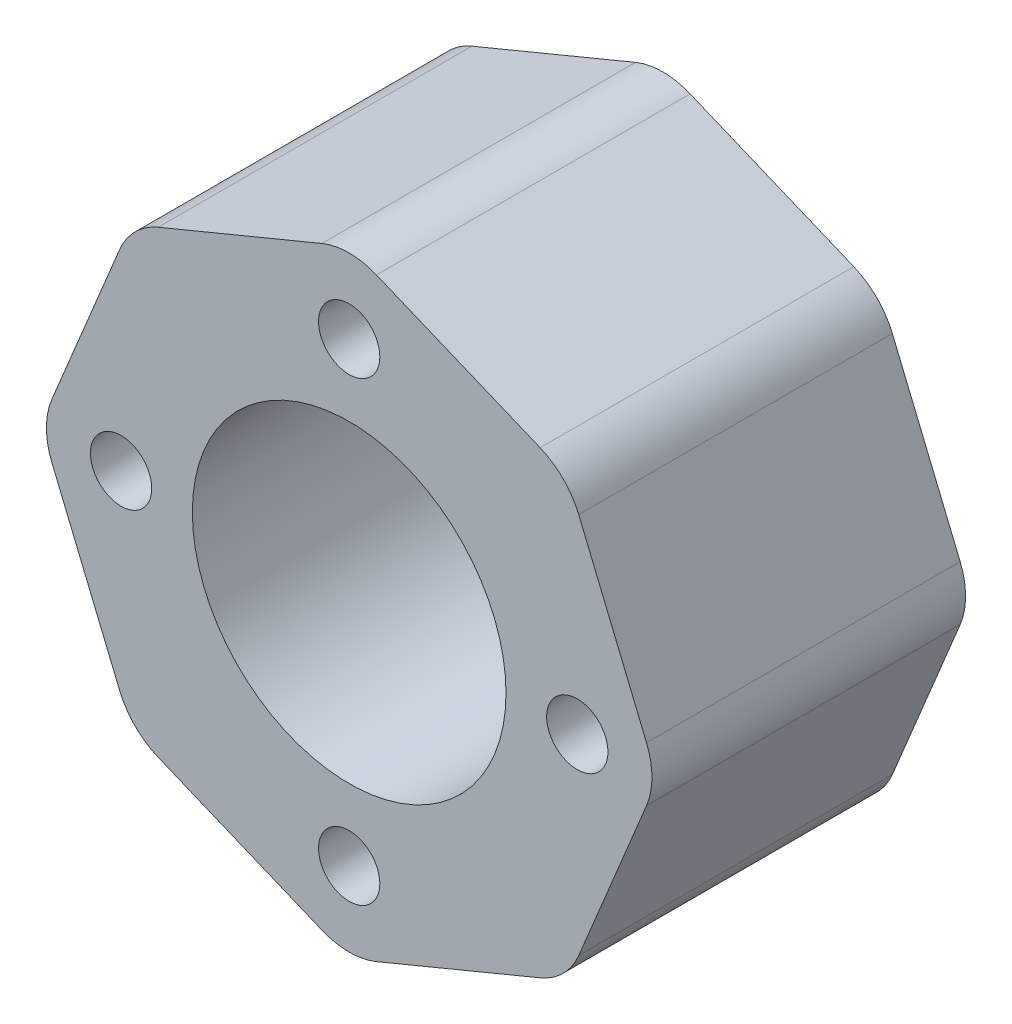
ISO-10303-21;
HEADER;
FILE_DESCRIPTION(('STEP AP214'),'2;1');
FILE_NAME('part.step','',(''),(''),'','','');
FILE_SCHEMA(('AUTOMOTIVE_DESIGN { 1 0 10303 214 1 1 1 1 }'));
ENDSEC;
DATA;
#1=APPLICATION_CONTEXT('core data for automotive mechanical design processes');
#2=APPLICATION_PROTOCOL_DEFINITION('international standard','automotive_design',2000,#1);
#3=PRODUCT_CONTEXT('',#1,'mechanical');
#4=PRODUCT('Part','Part','',(#3));
#5=PRODUCT_RELATED_PRODUCT_CATEGORY('part','',(#4));
#6=PRODUCT_DEFINITION_FORMATION('','',#4);
#7=PRODUCT_DEFINITION_CONTEXT('part definition',#1,'design');
#8=PRODUCT_DEFINITION('design','',#6,#7);
#9=PRODUCT_DEFINITION_SHAPE('','',#8);
#10=(LENGTH_UNIT() NAMED_UNIT(*) SI_UNIT(.MILLI.,.METRE.));
#11=(NAMED_UNIT(*) PLANE_ANGLE_UNIT() SI_UNIT($,.RADIAN.));
#12=(NAMED_UNIT(*) SI_UNIT($,.STERADIAN.) SOLID_ANGLE_UNIT());
#13=UNCERTAINTY_MEASURE_WITH_UNIT(LENGTH_MEASURE(1.E-05),#10,'distance_accuracy_value','');
#14=(GEOMETRIC_REPRESENTATION_CONTEXT(3) GLOBAL_UNCERTAINTY_ASSIGNED_CONTEXT((#13)) GLOBAL_UNIT_ASSIGNED_CONTEXT((#10,
#11,#12)) REPRESENTATION_CONTEXT('',''));
#15=CARTESIAN_POINT('',(0.,0.,0.));
#16=DIRECTION('',(0.,0.,1.));
#17=DIRECTION('',(1.,0.,0.));
#18=AXIS2_PLACEMENT_3D('',#15,#16,#17);
#19=CARTESIAN_POINT('',(15.3073372946037,-15.3073372946035,22.));
#20=DIRECTION('',(-0.92387953251129,0.382683432365083,0.));
#21=DIRECTION('',(-0.382683432365083,-0.92387953251129,0.));
#22=AXIS2_PLACEMENT_3D('',#19,#20,#21);
#23=PLANE('',#22);
#24=DIRECTION('',(0.382683432365083,0.923879532511289,0.));
#25=VECTOR('',#24,1.);
#26=CARTESIAN_POINT('',(15.3073372946037,-15.3073372946035,0.));
#27=LINE('',#26,#25);
#28=CARTESIAN_POINT('',(16.0999006335092,-13.393920132778,0.));
#29=VERTEX_POINT('',#28);
#30=CARTESIAN_POINT('',(20.8552806669424,-1.91341716182531,0.));
#31=VERTEX_POINT('',#30);
#32=EDGE_CURVE('E174',#29,#31,#27,.T.);
#33=ORIENTED_EDGE('',*,*,#32,.T.);
#34=DIRECTION('',(0.,0.,-1.));
#35=VECTOR('',#34,1.);
#36=CARTESIAN_POINT('',(20.8552806669424,-1.91341716182531,22.));
#37=LINE('',#36,#35);
#38=CARTESIAN_POINT('',(20.8552806669424,-1.91341716182531,22.));
#39=VERTEX_POINT('',#38);
#40=EDGE_CURVE('E151',#31,#39,#37,.F.);
#41=ORIENTED_EDGE('',*,*,#40,.T.);
#42=DIRECTION('',(0.382683432365083,0.923879532511289,0.));
#43=VECTOR('',#42,1.);
#44=CARTESIAN_POINT('',(15.3073372946037,-15.3073372946035,22.));
#45=LINE('',#44,#43);
#46=CARTESIAN_POINT('',(16.0999006335092,-13.393920132778,22.));
#47=VERTEX_POINT('',#46);
#48=EDGE_CURVE('E196',#47,#39,#45,.T.);
#49=ORIENTED_EDGE('',*,*,#48,.F.);
#50=DIRECTION('',(0.,0.,-1.));
#51=VECTOR('',#50,1.);
#52=CARTESIAN_POINT('',(16.0999006335092,-13.393920132778,22.));
#53=LINE('',#52,#51);
#54=EDGE_CURVE('E156',#47,#29,#53,.T.);
#55=ORIENTED_EDGE('',*,*,#54,.T.);
#56=EDGE_LOOP('',(#33,#41,#49,#55));
#57=FACE_BOUND('',#56,.T.);
#58=ADVANCED_FACE('F32',(#57),#23,.F.);
#59=CARTESIAN_POINT('',(21.6478440058479,1.45654525981744E-13,22.));
#60=DIRECTION('',(-0.923879532511284,-0.382683432365096,0.));
#61=DIRECTION('',(0.382683432365096,-0.923879532511284,0.));
#62=AXIS2_PLACEMENT_3D('',#59,#60,#61);
#63=PLANE('',#62);
#64=DIRECTION('',(-0.382683432365096,0.923879532511284,0.));
#65=VECTOR('',#64,1.);
#66=CARTESIAN_POINT('',(21.6478440058479,1.45654525981744E-13,22.));
#67=LINE('',#66,#65);
#68=CARTESIAN_POINT('',(20.8552806669423,1.91341716182559,22.));
#69=VERTEX_POINT('',#68);
#70=CARTESIAN_POINT('',(16.099900633509,13.3939201327782,22.));
#71=VERTEX_POINT('',#70);
#72=EDGE_CURVE('E166',#69,#71,#67,.T.);
#73=ORIENTED_EDGE('',*,*,#72,.F.);
#74=DIRECTION('',(0.,0.,-1.));
#75=VECTOR('',#74,1.);
#76=CARTESIAN_POINT('',(20.8552806669423,1.91341716182559,22.));
#77=LINE('',#76,#75);
#78=CARTESIAN_POINT('',(20.8552806669423,1.91341716182559,0.));
#79=VERTEX_POINT('',#78);
#80=EDGE_CURVE('E150',#69,#79,#77,.T.);
#81=ORIENTED_EDGE('',*,*,#80,.T.);
#82=DIRECTION('',(-0.382683432365096,0.923879532511284,0.));
#83=VECTOR('',#82,1.);
#84=CARTESIAN_POINT('',(21.6478440058479,1.45654525981744E-13,0.));
#85=LINE('',#84,#83);
#86=CARTESIAN_POINT('',(16.099900633509,13.3939201327782,0.));
#87=VERTEX_POINT('',#86);
#88=EDGE_CURVE('E163',#79,#87,#85,.T.);
#89=ORIENTED_EDGE('',*,*,#88,.T.);
#90=DIRECTION('',(0.,0.,-1.));
#91=VECTOR('',#90,1.);
#92=CARTESIAN_POINT('',(16.099900633509,13.3939201327782,22.));
#93=LINE('',#92,#91);
#94=EDGE_CURVE('E168',#87,#71,#93,.F.);
#95=ORIENTED_EDGE('',*,*,#94,.T.);
#96=EDGE_LOOP('',(#73,#81,#89,#95));
#97=FACE_BOUND('',#96,.T.);
#98=ADVANCED_FACE('F162',(#97),#63,.F.);
#99=CARTESIAN_POINT('',(15.3073372946035,15.3073372946037,22.));
#100=DIRECTION('',(-0.382683432365084,-0.923879532511289,0.));
#101=DIRECTION('',(0.923879532511289,-0.382683432365084,0.));
#102=AXIS2_PLACEMENT_3D('',#99,#100,#101);
#103=PLANE('',#102);
#104=DIRECTION('',(-0.923879532511289,0.382683432365084,0.));
#105=VECTOR('',#104,1.);
#106=CARTESIAN_POINT('',(15.3073372946035,15.3073372946037,22.));
#107=LINE('',#106,#105);
#108=CARTESIAN_POINT('',(13.393920132778,16.0999006335092,22.));
#109=VERTEX_POINT('',#108);
#110=CARTESIAN_POINT('',(1.9134171618253,20.8552806669424,22.));
#111=VERTEX_POINT('',#110);
#112=EDGE_CURVE('E279',#109,#111,#107,.T.);
#113=ORIENTED_EDGE('',*,*,#112,.F.);
#114=DIRECTION('',(0.,0.,-1.));
#115=VECTOR('',#114,1.);
#116=CARTESIAN_POINT('',(13.393920132778,16.0999006335092,22.));
#117=LINE('',#116,#115);
#118=CARTESIAN_POINT('',(13.393920132778,16.0999006335092,0.));
#119=VERTEX_POINT('',#118);
#120=EDGE_CURVE('E234',#109,#119,#117,.T.);
#121=ORIENTED_EDGE('',*,*,#120,.T.);
#122=DIRECTION('',(-0.923879532511289,0.382683432365084,0.));
#123=VECTOR('',#122,1.);
#124=CARTESIAN_POINT('',(15.3073372946035,15.3073372946037,0.));
#125=LINE('',#124,#123);
#126=CARTESIAN_POINT('',(1.9134171618253,20.8552806669424,0.));
#127=VERTEX_POINT('',#126);
#128=EDGE_CURVE('E173',#119,#127,#125,.T.);
#129=ORIENTED_EDGE('',*,*,#128,.T.);
#130=DIRECTION('',(0.,0.,-1.));
#131=VECTOR('',#130,1.);
#132=CARTESIAN_POINT('',(1.9134171618253,20.8552806669424,22.));
#133=LINE('',#132,#131);
#134=EDGE_CURVE('E232',#127,#111,#133,.F.);
#135=ORIENTED_EDGE('',*,*,#134,.T.);
#136=EDGE_LOOP('',(#113,#121,#129,#135));
#137=FACE_BOUND('',#136,.T.);
#138=ADVANCED_FACE('F325',(#137),#103,.F.);
#139=CARTESIAN_POINT('',(-1.49576889375111E-13,21.6478440058479,22.));
#140=DIRECTION('',(0.382683432365096,-0.923879532511284,0.));
#141=DIRECTION('',(0.923879532511284,0.382683432365096,0.));
#142=AXIS2_PLACEMENT_3D('',#139,#140,#141);
#143=PLANE('',#142);
#144=DIRECTION('',(-0.923879532511284,-0.382683432365096,0.));
#145=VECTOR('',#144,1.);
#146=CARTESIAN_POINT('',(-1.49576889375111E-13,21.6478440058479,0.));
#147=LINE('',#146,#145);
#148=CARTESIAN_POINT('',(-1.9134171618256,20.8552806669423,0.));
#149=VERTEX_POINT('',#148);
#150=CARTESIAN_POINT('',(-13.3939201327783,16.099900633509,0.));
#151=VERTEX_POINT('',#150);
#152=EDGE_CURVE('E177',#149,#151,#147,.T.);
#153=ORIENTED_EDGE('',*,*,#152,.T.);
#154=DIRECTION('',(0.,0.,-1.));
#155=VECTOR('',#154,1.);
#156=CARTESIAN_POINT('',(-13.3939201327783,16.099900633509,22.));
#157=LINE('',#156,#155);
#158=CARTESIAN_POINT('',(-13.3939201327783,16.099900633509,22.));
#159=VERTEX_POINT('',#158);
#160=EDGE_CURVE('E11',#151,#159,#157,.F.);
#161=ORIENTED_EDGE('',*,*,#160,.T.);
#162=DIRECTION('',(-0.923879532511284,-0.382683432365096,0.));
#163=VECTOR('',#162,1.);
#164=CARTESIAN_POINT('',(-1.49576889375111E-13,21.6478440058479,22.));
#165=LINE('',#164,#163);
#166=CARTESIAN_POINT('',(-1.9134171618256,20.8552806669423,22.));
#167=VERTEX_POINT('',#166);
#168=EDGE_CURVE('E259',#167,#159,#165,.T.);
#169=ORIENTED_EDGE('',*,*,#168,.F.);
#170=DIRECTION('',(0.,0.,-1.));
#171=VECTOR('',#170,1.);
#172=CARTESIAN_POINT('',(-1.9134171618256,20.8552806669423,22.));
#173=LINE('',#172,#171);
#174=EDGE_CURVE('E40',#167,#149,#173,.T.);
#175=ORIENTED_EDGE('',*,*,#174,.T.);
#176=EDGE_LOOP('',(#153,#161,#169,#175));
#177=FACE_BOUND('',#176,.T.);
#178=ADVANCED_FACE('F256',(#177),#143,.F.);
#179=CARTESIAN_POINT('',(-15.3073372946037,15.3073372946035,22.));
#180=DIRECTION('',(0.923879532511289,-0.382683432365084,0.));
#181=DIRECTION('',(0.382683432365084,0.923879532511289,0.));
#182=AXIS2_PLACEMENT_3D('',#179,#180,#181);
#183=PLANE('',#182);
#184=DIRECTION('',(-0.382683432365084,-0.923879532511289,0.));
#185=VECTOR('',#184,1.);
#186=CARTESIAN_POINT('',(-15.3073372946037,15.3073372946035,0.));
#187=LINE('',#186,#185);
#188=CARTESIAN_POINT('',(-16.0999006335092,13.393920132778,0.));
#189=VERTEX_POINT('',#188);
#190=CARTESIAN_POINT('',(-20.8552806669424,1.91341716182531,0.));
#191=VERTEX_POINT('',#190);
#192=EDGE_CURVE('E185',#189,#191,#187,.T.);
#193=ORIENTED_EDGE('',*,*,#192,.T.);
#194=DIRECTION('',(0.,0.,-1.));
#195=VECTOR('',#194,1.);
#196=CARTESIAN_POINT('',(-20.8552806669424,1.91341716182531,22.));
#197=LINE('',#196,#195);
#198=CARTESIAN_POINT('',(-20.8552806669424,1.91341716182531,22.));
#199=VERTEX_POINT('',#198);
#200=EDGE_CURVE('E250',#191,#199,#197,.F.);
#201=ORIENTED_EDGE('',*,*,#200,.T.);
#202=DIRECTION('',(-0.382683432365084,-0.923879532511289,0.));
#203=VECTOR('',#202,1.);
#204=CARTESIAN_POINT('',(-15.3073372946037,15.3073372946035,22.));
#205=LINE('',#204,#203);
#206=CARTESIAN_POINT('',(-16.0999006335092,13.393920132778,22.));
#207=VERTEX_POINT('',#206);
#208=EDGE_CURVE('E272',#207,#199,#205,.T.);
#209=ORIENTED_EDGE('',*,*,#208,.F.);
#210=DIRECTION('',(0.,0.,-1.));
#211=VECTOR('',#210,1.);
#212=CARTESIAN_POINT('',(-16.0999006335092,13.393920132778,22.));
#213=LINE('',#212,#211);
#214=EDGE_CURVE('E247',#207,#189,#213,.T.);
#215=ORIENTED_EDGE('',*,*,#214,.T.);
#216=EDGE_LOOP('',(#193,#201,#209,#215));
#217=FACE_BOUND('',#216,.T.);
#218=ADVANCED_FACE('F269',(#217),#183,.F.);
#219=CARTESIAN_POINT('',(-21.6478440058479,-1.45743135759298E-13,22.));
#220=DIRECTION('',(0.923879532511284,0.382683432365096,0.));
#221=DIRECTION('',(-0.382683432365096,0.923879532511284,0.));
#222=AXIS2_PLACEMENT_3D('',#219,#220,#221);
#223=PLANE('',#222);
#224=DIRECTION('',(0.382683432365096,-0.923879532511284,0.));
#225=VECTOR('',#224,1.);
#226=CARTESIAN_POINT('',(-21.6478440058479,-1.45743135759298E-13,0.));
#227=LINE('',#226,#225);
#228=CARTESIAN_POINT('',(-20.8552806669423,-1.91341716182559,0.));
#229=VERTEX_POINT('',#228);
#230=CARTESIAN_POINT('',(-16.099900633509,-13.3939201327782,0.));
#231=VERTEX_POINT('',#230);
#232=EDGE_CURVE('E188',#229,#231,#227,.T.);
#233=ORIENTED_EDGE('',*,*,#232,.T.);
#234=DIRECTION('',(0.,0.,-1.));
#235=VECTOR('',#234,1.);
#236=CARTESIAN_POINT('',(-16.099900633509,-13.3939201327783,22.));
#237=LINE('',#236,#235);
#238=CARTESIAN_POINT('',(-16.099900633509,-13.3939201327782,22.));
#239=VERTEX_POINT('',#238);
#240=EDGE_CURVE('E245',#231,#239,#237,.F.);
#241=ORIENTED_EDGE('',*,*,#240,.T.);
#242=DIRECTION('',(0.382683432365096,-0.923879532511284,0.));
#243=VECTOR('',#242,1.);
#244=CARTESIAN_POINT('',(-21.6478440058479,-1.45743135759298E-13,22.));
#245=LINE('',#244,#243);
#246=CARTESIAN_POINT('',(-20.8552806669423,-1.91341716182559,22.));
#247=VERTEX_POINT('',#246);
#248=EDGE_CURVE('E274',#247,#239,#245,.T.);
#249=ORIENTED_EDGE('',*,*,#248,.F.);
#250=DIRECTION('',(0.,0.,-1.));
#251=VECTOR('',#250,1.);
#252=CARTESIAN_POINT('',(-20.8552806669423,-1.91341716182559,22.));
#253=LINE('',#252,#251);
#254=EDGE_CURVE('E242',#247,#229,#253,.T.);
#255=ORIENTED_EDGE('',*,*,#254,.T.);
#256=EDGE_LOOP('',(#233,#241,#249,#255));
#257=FACE_BOUND('',#256,.T.);
#258=ADVANCED_FACE('F308',(#257),#223,.F.);
#259=CARTESIAN_POINT('',(-15.3073372946035,-15.3073372946037,22.));
#260=DIRECTION('',(0.382683432365084,0.923879532511289,0.));
#261=DIRECTION('',(-0.923879532511289,0.382683432365084,0.));
#262=AXIS2_PLACEMENT_3D('',#259,#260,#261);
#263=PLANE('',#262);
#264=DIRECTION('',(0.923879532511289,-0.382683432365084,0.));
#265=VECTOR('',#264,1.);
#266=CARTESIAN_POINT('',(-15.3073372946035,-15.3073372946037,0.));
#267=LINE('',#266,#265);
#268=CARTESIAN_POINT('',(-13.393920132778,-16.0999006335092,0.));
#269=VERTEX_POINT('',#268);
#270=CARTESIAN_POINT('',(-1.91341716182531,-20.8552806669424,0.));
#271=VERTEX_POINT('',#270);
#272=EDGE_CURVE('E191',#269,#271,#267,.T.);
#273=ORIENTED_EDGE('',*,*,#272,.T.);
#274=DIRECTION('',(0.,0.,-1.));
#275=VECTOR('',#274,1.);
#276=CARTESIAN_POINT('',(-1.91341716182531,-20.8552806669424,22.));
#277=LINE('',#276,#275);
#278=CARTESIAN_POINT('',(-1.91341716182531,-20.8552806669424,22.));
#279=VERTEX_POINT('',#278);
#280=EDGE_CURVE('E240',#271,#279,#277,.F.);
#281=ORIENTED_EDGE('',*,*,#280,.T.);
#282=DIRECTION('',(0.923879532511289,-0.382683432365084,0.));
#283=VECTOR('',#282,1.);
#284=CARTESIAN_POINT('',(-15.3073372946035,-15.3073372946037,22.));
#285=LINE('',#284,#283);
#286=CARTESIAN_POINT('',(-13.393920132778,-16.0999006335092,22.));
#287=VERTEX_POINT('',#286);
#288=EDGE_CURVE('E277',#287,#279,#285,.T.);
#289=ORIENTED_EDGE('',*,*,#288,.F.);
#290=DIRECTION('',(0.,0.,-1.));
#291=VECTOR('',#290,1.);
#292=CARTESIAN_POINT('',(-13.393920132778,-16.0999006335092,22.));
#293=LINE('',#292,#291);
#294=EDGE_CURVE('E237',#287,#269,#293,.T.);
#295=ORIENTED_EDGE('',*,*,#294,.T.);
#296=EDGE_LOOP('',(#273,#281,#289,#295));
#297=FACE_BOUND('',#296,.T.);
#298=ADVANCED_FACE('F299',(#297),#263,.F.);
#299=CARTESIAN_POINT('',(1.40295761119624E-13,-21.6478440058479,22.));
#300=DIRECTION('',(-0.382683432365096,0.923879532511284,0.));
#301=DIRECTION('',(-0.923879532511284,-0.382683432365096,0.));
#302=AXIS2_PLACEMENT_3D('',#299,#300,#301);
#303=PLANE('',#302);
#304=DIRECTION('',(0.923879532511284,0.382683432365096,0.));
#305=VECTOR('',#304,1.);
#306=CARTESIAN_POINT('',(1.40295761119624E-13,-21.6478440058479,0.));
#307=LINE('',#306,#305);
#308=CARTESIAN_POINT('',(1.91341716182559,-20.8552806669423,0.));
#309=VERTEX_POINT('',#308);
#310=CARTESIAN_POINT('',(13.3939201327782,-16.099900633509,0.));
#311=VERTEX_POINT('',#310);
#312=EDGE_CURVE('E194',#309,#311,#307,.T.);
#313=ORIENTED_EDGE('',*,*,#312,.T.);
#314=DIRECTION('',(0.,0.,-1.));
#315=VECTOR('',#314,1.);
#316=CARTESIAN_POINT('',(13.3939201327782,-16.099900633509,22.));
#317=LINE('',#316,#315);
#318=CARTESIAN_POINT('',(13.3939201327782,-16.099900633509,22.));
#319=VERTEX_POINT('',#318);
#320=EDGE_CURVE('E47',#311,#319,#317,.F.);
#321=ORIENTED_EDGE('',*,*,#320,.T.);
#322=DIRECTION('',(0.923879532511284,0.382683432365096,0.));
#323=VECTOR('',#322,1.);
#324=CARTESIAN_POINT('',(1.40295761119624E-13,-21.6478440058479,22.));
#325=LINE('',#324,#323);
#326=CARTESIAN_POINT('',(1.91341716182559,-20.8552806669423,22.));
#327=VERTEX_POINT('',#326);
#328=EDGE_CURVE('E197',#327,#319,#325,.T.);
#329=ORIENTED_EDGE('',*,*,#328,.F.);
#330=DIRECTION('',(0.,0.,-1.));
#331=VECTOR('',#330,1.);
#332=CARTESIAN_POINT('',(1.91341716182559,-20.8552806669423,22.));
#333=LINE('',#332,#331);
#334=EDGE_CURVE('E228',#327,#309,#333,.T.);
#335=ORIENTED_EDGE('',*,*,#334,.T.);
#336=EDGE_LOOP('',(#313,#321,#329,#335));
#337=FACE_BOUND('',#336,.T.);
#338=ADVANCED_FACE('F293',(#337),#303,.F.);
#339=CARTESIAN_POINT('',(0.,0.,22.));
#340=DIRECTION('',(0.,0.,1.));
#341=DIRECTION('',(1.,0.,0.));
#342=AXIS2_PLACEMENT_3D('',#339,#340,#341);
#343=PLANE('',#342);
#344=CARTESIAN_POINT('',(0.,0.,22.));
#345=DIRECTION('',(0.,0.,1.));
#346=DIRECTION('',(1.,0.,0.));
#347=AXIS2_PLACEMENT_3D('',#344,#345,#346);
#348=CIRCLE('',#347,11.);
#349=CARTESIAN_POINT('',(11.,0.,22.));
#350=VERTEX_POINT('',#349);
#351=EDGE_CURVE('E485',#350,#350,#348,.T.);
#352=ORIENTED_EDGE('',*,*,#351,.F.);
#353=EDGE_LOOP('',(#352));
#354=FACE_BOUND('',#353,.T.);
#355=CARTESIAN_POINT('',(0.,16.,22.));
#356=DIRECTION('',(0.,0.,1.));
#357=DIRECTION('',(1.,0.,0.));
#358=AXIS2_PLACEMENT_3D('',#355,#356,#357);
#359=CIRCLE('',#358,2.14999999999999);
#360=CARTESIAN_POINT('',(2.14999999999999,16.,22.));
#361=VERTEX_POINT('',#360);
#362=EDGE_CURVE('E481',#361,#361,#359,.T.);
#363=ORIENTED_EDGE('',*,*,#362,.F.);
#364=EDGE_LOOP('',(#363));
#365=FACE_BOUND('',#364,.T.);
#366=CARTESIAN_POINT('',(16.,0.,22.));
#367=DIRECTION('',(0.,0.,1.));
#368=DIRECTION('',(1.,0.,0.));
#369=AXIS2_PLACEMENT_3D('',#366,#367,#368);
#370=CIRCLE('',#369,2.14999999999999);
#371=CARTESIAN_POINT('',(18.15,0.,22.));
#372=VERTEX_POINT('',#371);
#373=EDGE_CURVE('E475',#372,#372,#370,.T.);
#374=ORIENTED_EDGE('',*,*,#373,.F.);
#375=EDGE_LOOP('',(#374));
#376=FACE_BOUND('',#375,.T.);
#377=CARTESIAN_POINT('',(0.,-16.,22.));
#378=DIRECTION('',(0.,0.,1.));
#379=DIRECTION('',(1.,0.,0.));
#380=AXIS2_PLACEMENT_3D('',#377,#378,#379);
#381=CIRCLE('',#380,2.14999999999999);
#382=CARTESIAN_POINT('',(2.14999999999999,-16.,22.));
#383=VERTEX_POINT('',#382);
#384=EDGE_CURVE('E469',#383,#383,#381,.T.);
#385=ORIENTED_EDGE('',*,*,#384,.F.);
#386=EDGE_LOOP('',(#385));
#387=FACE_BOUND('',#386,.T.);
#388=CARTESIAN_POINT('',(-16.,0.,22.));
#389=DIRECTION('',(0.,0.,1.));
#390=DIRECTION('',(1.,0.,0.));
#391=AXIS2_PLACEMENT_3D('',#388,#389,#390);
#392=CIRCLE('',#391,2.14999999999999);
#393=CARTESIAN_POINT('',(-13.85,0.,22.));
#394=VERTEX_POINT('',#393);
#395=EDGE_CURVE('E463',#394,#394,#392,.T.);
#396=ORIENTED_EDGE('',*,*,#395,.F.);
#397=EDGE_LOOP('',(#396));
#398=FACE_BOUND('',#397,.T.);
#399=ORIENTED_EDGE('',*,*,#48,.T.);
#400=CARTESIAN_POINT('',(16.2358830043859,1.07986536379556E-13,22.));
#401=DIRECTION('',(0.,0.,1.));
#402=DIRECTION('',(1.,0.,0.));
#403=AXIS2_PLACEMENT_3D('',#400,#401,#402);
#404=CIRCLE('',#403,5.);
#405=EDGE_CURVE('E226',#39,#69,#404,.T.);
#406=ORIENTED_EDGE('',*,*,#405,.T.);
#407=ORIENTED_EDGE('',*,*,#72,.T.);
#408=CARTESIAN_POINT('',(11.4805029709526,11.4805029709528,22.));
#409=DIRECTION('',(0.,0.,1.));
#410=DIRECTION('',(1.,0.,0.));
#411=AXIS2_PLACEMENT_3D('',#408,#409,#410);
#412=CIRCLE('',#411,5.);
#413=EDGE_CURVE('E222',#71,#109,#412,.T.);
#414=ORIENTED_EDGE('',*,*,#413,.T.);
#415=ORIENTED_EDGE('',*,*,#112,.T.);
#416=CARTESIAN_POINT('',(-1.15142270717961E-13,16.2358830043859,22.));
#417=DIRECTION('',(0.,0.,1.));
#418=DIRECTION('',(1.,0.,0.));
#419=AXIS2_PLACEMENT_3D('',#416,#417,#418);
#420=CIRCLE('',#419,5.);
#421=EDGE_CURVE('E213',#111,#167,#420,.T.);
#422=ORIENTED_EDGE('',*,*,#421,.T.);
#423=ORIENTED_EDGE('',*,*,#168,.T.);
#424=CARTESIAN_POINT('',(-11.4805029709528,11.4805029709526,22.));
#425=DIRECTION('',(0.,0.,1.));
#426=DIRECTION('',(1.,0.,0.));
#427=AXIS2_PLACEMENT_3D('',#424,#425,#426);
#428=CIRCLE('',#427,5.);
#429=EDGE_CURVE('E215',#159,#207,#428,.T.);
#430=ORIENTED_EDGE('',*,*,#429,.T.);
#431=ORIENTED_EDGE('',*,*,#208,.T.);
#432=CARTESIAN_POINT('',(-16.2358830043859,-1.10805462028019E-13,22.));
#433=DIRECTION('',(0.,0.,1.));
#434=DIRECTION('',(1.,0.,0.));
#435=AXIS2_PLACEMENT_3D('',#432,#433,#434);
#436=CIRCLE('',#435,5.);
#437=EDGE_CURVE('E217',#199,#247,#436,.T.);
#438=ORIENTED_EDGE('',*,*,#437,.T.);
#439=ORIENTED_EDGE('',*,*,#248,.T.);
#440=CARTESIAN_POINT('',(-11.4805029709526,-11.4805029709528,22.));
#441=DIRECTION('',(0.,0.,1.));
#442=DIRECTION('',(1.,0.,0.));
#443=AXIS2_PLACEMENT_3D('',#440,#441,#442);
#444=CIRCLE('',#443,5.);
#445=EDGE_CURVE('E219',#239,#287,#444,.T.);
#446=ORIENTED_EDGE('',*,*,#445,.T.);
#447=ORIENTED_EDGE('',*,*,#288,.T.);
#448=CARTESIAN_POINT('',(1.08203376814053E-13,-16.2358830043859,22.));
#449=DIRECTION('',(0.,0.,1.));
#450=DIRECTION('',(1.,0.,0.));
#451=AXIS2_PLACEMENT_3D('',#448,#449,#450);
#452=CIRCLE('',#451,5.);
#453=EDGE_CURVE('E54',#279,#327,#452,.T.);
#454=ORIENTED_EDGE('',*,*,#453,.T.);
#455=ORIENTED_EDGE('',*,*,#328,.T.);
#456=CARTESIAN_POINT('',(11.4805029709528,-11.4805029709526,22.));
#457=DIRECTION('',(0.,0.,1.));
#458=DIRECTION('',(1.,0.,0.));
#459=AXIS2_PLACEMENT_3D('',#456,#457,#458);
#460=CIRCLE('',#459,5.);
#461=EDGE_CURVE('E224',#319,#47,#460,.T.);
#462=ORIENTED_EDGE('',*,*,#461,.T.);
#463=EDGE_LOOP('',(#399,#406,#407,#414,#415,#422,#423,#430,#431,#438,#439,#446,#447,#454,#455,#462));
#464=FACE_BOUND('',#463,.T.);
#465=ADVANCED_FACE('F285',(#354,#365,#376,#387,#398,#464),#343,.T.);
#466=CARTESIAN_POINT('',(0.,0.,0.));
#467=DIRECTION('',(0.,0.,1.));
#468=DIRECTION('',(1.,0.,0.));
#469=AXIS2_PLACEMENT_3D('',#466,#467,#468);
#470=PLANE('',#469);
#471=CARTESIAN_POINT('',(0.,0.,0.));
#472=DIRECTION('',(0.,0.,1.));
#473=DIRECTION('',(1.,0.,0.));
#474=AXIS2_PLACEMENT_3D('',#471,#472,#473);
#475=CIRCLE('',#474,11.);
#476=CARTESIAN_POINT('',(11.,0.,0.));
#477=VERTEX_POINT('',#476);
#478=EDGE_CURVE('E484',#477,#477,#475,.T.);
#479=ORIENTED_EDGE('',*,*,#478,.T.);
#480=EDGE_LOOP('',(#479));
#481=FACE_BOUND('',#480,.T.);
#482=CARTESIAN_POINT('',(0.,16.,0.));
#483=DIRECTION('',(0.,0.,1.));
#484=DIRECTION('',(1.,0.,0.));
#485=AXIS2_PLACEMENT_3D('',#482,#483,#484);
#486=CIRCLE('',#485,2.15);
#487=CARTESIAN_POINT('',(2.15,16.,0.));
#488=VERTEX_POINT('',#487);
#489=EDGE_CURVE('E478',#488,#488,#486,.T.);
#490=ORIENTED_EDGE('',*,*,#489,.T.);
#491=EDGE_LOOP('',(#490));
#492=FACE_BOUND('',#491,.T.);
#493=CARTESIAN_POINT('',(16.,0.,0.));
#494=DIRECTION('',(0.,0.,1.));
#495=DIRECTION('',(1.,0.,0.));
#496=AXIS2_PLACEMENT_3D('',#493,#494,#495);
#497=CIRCLE('',#496,2.15);
#498=CARTESIAN_POINT('',(18.15,0.,0.));
#499=VERTEX_POINT('',#498);
#500=EDGE_CURVE('E472',#499,#499,#497,.T.);
#501=ORIENTED_EDGE('',*,*,#500,.T.);
#502=EDGE_LOOP('',(#501));
#503=FACE_BOUND('',#502,.T.);
#504=CARTESIAN_POINT('',(0.,-16.,0.));
#505=DIRECTION('',(0.,0.,1.));
#506=DIRECTION('',(1.,0.,0.));
#507=AXIS2_PLACEMENT_3D('',#504,#505,#506);
#508=CIRCLE('',#507,2.15);
#509=CARTESIAN_POINT('',(2.15,-16.,0.));
#510=VERTEX_POINT('',#509);
#511=EDGE_CURVE('E466',#510,#510,#508,.T.);
#512=ORIENTED_EDGE('',*,*,#511,.T.);
#513=EDGE_LOOP('',(#512));
#514=FACE_BOUND('',#513,.T.);
#515=CARTESIAN_POINT('',(-16.,0.,0.));
#516=DIRECTION('',(0.,0.,1.));
#517=DIRECTION('',(1.,0.,0.));
#518=AXIS2_PLACEMENT_3D('',#515,#516,#517);
#519=CIRCLE('',#518,2.15);
#520=CARTESIAN_POINT('',(-13.85,0.,0.));
#521=VERTEX_POINT('',#520);
#522=EDGE_CURVE('E179',#521,#521,#519,.T.);
#523=ORIENTED_EDGE('',*,*,#522,.T.);
#524=EDGE_LOOP('',(#523));
#525=FACE_BOUND('',#524,.T.);
#526=ORIENTED_EDGE('',*,*,#88,.F.);
#527=CARTESIAN_POINT('',(16.2358830043859,1.07986536379556E-13,0.));
#528=DIRECTION('',(0.,0.,1.));
#529=DIRECTION('',(1.,0.,0.));
#530=AXIS2_PLACEMENT_3D('',#527,#528,#529);
#531=CIRCLE('',#530,5.);
#532=EDGE_CURVE('E146',#79,#31,#531,.F.);
#533=ORIENTED_EDGE('',*,*,#532,.T.);
#534=ORIENTED_EDGE('',*,*,#32,.F.);
#535=CARTESIAN_POINT('',(11.4805029709528,-11.4805029709526,0.));
#536=DIRECTION('',(0.,0.,1.));
#537=DIRECTION('',(1.,0.,0.));
#538=AXIS2_PLACEMENT_3D('',#535,#536,#537);
#539=CIRCLE('',#538,5.);
#540=EDGE_CURVE('E157',#29,#311,#539,.F.);
#541=ORIENTED_EDGE('',*,*,#540,.T.);
#542=ORIENTED_EDGE('',*,*,#312,.F.);
#543=CARTESIAN_POINT('',(1.08203376814053E-13,-16.2358830043859,0.));
#544=DIRECTION('',(0.,0.,1.));
#545=DIRECTION('',(1.,0.,0.));
#546=AXIS2_PLACEMENT_3D('',#543,#544,#545);
#547=CIRCLE('',#546,5.);
#548=EDGE_CURVE('E206',#309,#271,#547,.F.);
#549=ORIENTED_EDGE('',*,*,#548,.T.);
#550=ORIENTED_EDGE('',*,*,#272,.F.);
#551=CARTESIAN_POINT('',(-11.4805029709526,-11.4805029709528,0.));
#552=DIRECTION('',(0.,0.,1.));
#553=DIRECTION('',(1.,0.,0.));
#554=AXIS2_PLACEMENT_3D('',#551,#552,#553);
#555=CIRCLE('',#554,5.);
#556=EDGE_CURVE('E204',#269,#231,#555,.F.);
#557=ORIENTED_EDGE('',*,*,#556,.T.);
#558=ORIENTED_EDGE('',*,*,#232,.F.);
#559=CARTESIAN_POINT('',(-16.2358830043859,-1.10805462028019E-13,0.));
#560=DIRECTION('',(0.,0.,1.));
#561=DIRECTION('',(1.,0.,0.));
#562=AXIS2_PLACEMENT_3D('',#559,#560,#561);
#563=CIRCLE('',#562,5.);
#564=EDGE_CURVE('E202',#229,#191,#563,.F.);
#565=ORIENTED_EDGE('',*,*,#564,.T.);
#566=ORIENTED_EDGE('',*,*,#192,.F.);
#567=CARTESIAN_POINT('',(-11.4805029709528,11.4805029709526,0.));
#568=DIRECTION('',(0.,0.,1.));
#569=DIRECTION('',(1.,0.,0.));
#570=AXIS2_PLACEMENT_3D('',#567,#568,#569);
#571=CIRCLE('',#570,5.);
#572=EDGE_CURVE('E200',#189,#151,#571,.F.);
#573=ORIENTED_EDGE('',*,*,#572,.T.);
#574=ORIENTED_EDGE('',*,*,#152,.F.);
#575=CARTESIAN_POINT('',(-1.15142270717961E-13,16.2358830043859,0.));
#576=DIRECTION('',(0.,0.,1.));
#577=DIRECTION('',(1.,0.,0.));
#578=AXIS2_PLACEMENT_3D('',#575,#576,#577);
#579=CIRCLE('',#578,5.);
#580=EDGE_CURVE('E167',#149,#127,#579,.F.);
#581=ORIENTED_EDGE('',*,*,#580,.T.);
#582=ORIENTED_EDGE('',*,*,#128,.F.);
#583=CARTESIAN_POINT('',(11.4805029709526,11.4805029709528,0.));
#584=DIRECTION('',(0.,0.,1.));
#585=DIRECTION('',(1.,0.,0.));
#586=AXIS2_PLACEMENT_3D('',#583,#584,#585);
#587=CIRCLE('',#586,5.);
#588=EDGE_CURVE('E172',#119,#87,#587,.F.);
#589=ORIENTED_EDGE('',*,*,#588,.T.);
#590=EDGE_LOOP('',(#526,#533,#534,#541,#542,#549,#550,#557,#558,#565,#566,#573,#574,#581,#582,#589));
#591=FACE_BOUND('',#590,.T.);
#592=ADVANCED_FACE('F170',(#481,#492,#503,#514,#525,#591),#470,.F.);
#593=CARTESIAN_POINT('',(16.2358830043859,1.07986536379556E-13,22.));
#594=DIRECTION('',(0.,0.,-1.));
#595=DIRECTION('',(-1.,0.,0.));
#596=AXIS2_PLACEMENT_3D('',#593,#594,#595);
#597=CYLINDRICAL_SURFACE('',#596,5.);
#598=ORIENTED_EDGE('',*,*,#405,.F.);
#599=ORIENTED_EDGE('',*,*,#40,.F.);
#600=ORIENTED_EDGE('',*,*,#532,.F.);
#601=ORIENTED_EDGE('',*,*,#80,.F.);
#602=EDGE_LOOP('',(#598,#599,#600,#601));
#603=FACE_BOUND('',#602,.T.);
#604=ADVANCED_FACE('F149',(#603),#597,.T.);
#605=CARTESIAN_POINT('',(11.4805029709528,-11.4805029709526,22.));
#606=DIRECTION('',(0.,0.,-1.));
#607=DIRECTION('',(-1.,0.,0.));
#608=AXIS2_PLACEMENT_3D('',#605,#606,#607);
#609=CYLINDRICAL_SURFACE('',#608,5.);
#610=ORIENTED_EDGE('',*,*,#461,.F.);
#611=ORIENTED_EDGE('',*,*,#320,.F.);
#612=ORIENTED_EDGE('',*,*,#540,.F.);
#613=ORIENTED_EDGE('',*,*,#54,.F.);
#614=EDGE_LOOP('',(#610,#611,#612,#613));
#615=FACE_BOUND('',#614,.T.);
#616=ADVANCED_FACE('F290',(#615),#609,.T.);
#617=CARTESIAN_POINT('',(11.4805029709526,11.4805029709528,22.));
#618=DIRECTION('',(0.,0.,-1.));
#619=DIRECTION('',(-1.,0.,0.));
#620=AXIS2_PLACEMENT_3D('',#617,#618,#619);
#621=CYLINDRICAL_SURFACE('',#620,5.);
#622=ORIENTED_EDGE('',*,*,#413,.F.);
#623=ORIENTED_EDGE('',*,*,#94,.F.);
#624=ORIENTED_EDGE('',*,*,#588,.F.);
#625=ORIENTED_EDGE('',*,*,#120,.F.);
#626=EDGE_LOOP('',(#622,#623,#624,#625));
#627=FACE_BOUND('',#626,.T.);
#628=ADVANCED_FACE('F333',(#627),#621,.T.);
#629=CARTESIAN_POINT('',(1.08203376814053E-13,-16.2358830043859,22.));
#630=DIRECTION('',(0.,0.,-1.));
#631=DIRECTION('',(-1.,0.,0.));
#632=AXIS2_PLACEMENT_3D('',#629,#630,#631);
#633=CYLINDRICAL_SURFACE('',#632,5.);
#634=ORIENTED_EDGE('',*,*,#453,.F.);
#635=ORIENTED_EDGE('',*,*,#280,.F.);
#636=ORIENTED_EDGE('',*,*,#548,.F.);
#637=ORIENTED_EDGE('',*,*,#334,.F.);
#638=EDGE_LOOP('',(#634,#635,#636,#637));
#639=FACE_BOUND('',#638,.T.);
#640=ADVANCED_FACE('F295',(#639),#633,.T.);
#641=CARTESIAN_POINT('',(-11.4805029709526,-11.4805029709528,22.));
#642=DIRECTION('',(0.,0.,-1.));
#643=DIRECTION('',(-1.,0.,0.));
#644=AXIS2_PLACEMENT_3D('',#641,#642,#643);
#645=CYLINDRICAL_SURFACE('',#644,5.);
#646=ORIENTED_EDGE('',*,*,#445,.F.);
#647=ORIENTED_EDGE('',*,*,#240,.F.);
#648=ORIENTED_EDGE('',*,*,#556,.F.);
#649=ORIENTED_EDGE('',*,*,#294,.F.);
#650=EDGE_LOOP('',(#646,#647,#648,#649));
#651=FACE_BOUND('',#650,.T.);
#652=ADVANCED_FACE('F304',(#651),#645,.T.);
#653=CARTESIAN_POINT('',(-16.2358830043859,-1.10805462028019E-13,22.));
#654=DIRECTION('',(0.,0.,-1.));
#655=DIRECTION('',(-1.,0.,0.));
#656=AXIS2_PLACEMENT_3D('',#653,#654,#655);
#657=CYLINDRICAL_SURFACE('',#656,5.);
#658=ORIENTED_EDGE('',*,*,#437,.F.);
#659=ORIENTED_EDGE('',*,*,#200,.F.);
#660=ORIENTED_EDGE('',*,*,#564,.F.);
#661=ORIENTED_EDGE('',*,*,#254,.F.);
#662=EDGE_LOOP('',(#658,#659,#660,#661));
#663=FACE_BOUND('',#662,.T.);
#664=ADVANCED_FACE('F312',(#663),#657,.T.);
#665=CARTESIAN_POINT('',(-11.4805029709528,11.4805029709526,22.));
#666=DIRECTION('',(0.,0.,-1.));
#667=DIRECTION('',(-1.,0.,0.));
#668=AXIS2_PLACEMENT_3D('',#665,#666,#667);
#669=CYLINDRICAL_SURFACE('',#668,5.);
#670=ORIENTED_EDGE('',*,*,#429,.F.);
#671=ORIENTED_EDGE('',*,*,#160,.F.);
#672=ORIENTED_EDGE('',*,*,#572,.F.);
#673=ORIENTED_EDGE('',*,*,#214,.F.);
#674=EDGE_LOOP('',(#670,#671,#672,#673));
#675=FACE_BOUND('',#674,.T.);
#676=ADVANCED_FACE('F266',(#675),#669,.T.);
#677=CARTESIAN_POINT('',(-1.15142270717961E-13,16.2358830043859,22.));
#678=DIRECTION('',(0.,0.,-1.));
#679=DIRECTION('',(-1.,0.,0.));
#680=AXIS2_PLACEMENT_3D('',#677,#678,#679);
#681=CYLINDRICAL_SURFACE('',#680,5.);
#682=ORIENTED_EDGE('',*,*,#421,.F.);
#683=ORIENTED_EDGE('',*,*,#134,.F.);
#684=ORIENTED_EDGE('',*,*,#580,.F.);
#685=ORIENTED_EDGE('',*,*,#174,.F.);
#686=EDGE_LOOP('',(#682,#683,#684,#685));
#687=FACE_BOUND('',#686,.T.);
#688=ADVANCED_FACE('F34',(#687),#681,.T.);
#689=CARTESIAN_POINT('',(-16.,0.,22.));
#690=DIRECTION('',(0.,0.,1.));
#691=DIRECTION('',(1.,0.,0.));
#692=AXIS2_PLACEMENT_3D('',#689,#690,#691);
#693=CYLINDRICAL_SURFACE('',#692,2.14999999999999);
#694=ORIENTED_EDGE('',*,*,#522,.F.);
#695=EDGE_LOOP('',(#694));
#696=FACE_BOUND('',#695,.T.);
#697=ORIENTED_EDGE('',*,*,#395,.T.);
#698=EDGE_LOOP('',(#697));
#699=FACE_BOUND('',#698,.T.);
#700=ADVANCED_FACE('F365',(#696,#699),#693,.F.);
#701=CARTESIAN_POINT('',(0.,-16.,22.));
#702=DIRECTION('',(0.,0.,1.));
#703=DIRECTION('',(1.,0.,0.));
#704=AXIS2_PLACEMENT_3D('',#701,#702,#703);
#705=CYLINDRICAL_SURFACE('',#704,2.14999999999999);
#706=ORIENTED_EDGE('',*,*,#511,.F.);
#707=EDGE_LOOP('',(#706));
#708=FACE_BOUND('',#707,.T.);
#709=ORIENTED_EDGE('',*,*,#384,.T.);
#710=EDGE_LOOP('',(#709));
#711=FACE_BOUND('',#710,.T.);
#712=ADVANCED_FACE('F373',(#708,#711),#705,.F.);
#713=CARTESIAN_POINT('',(16.,0.,22.));
#714=DIRECTION('',(0.,0.,1.));
#715=DIRECTION('',(1.,0.,0.));
#716=AXIS2_PLACEMENT_3D('',#713,#714,#715);
#717=CYLINDRICAL_SURFACE('',#716,2.14999999999999);
#718=ORIENTED_EDGE('',*,*,#500,.F.);
#719=EDGE_LOOP('',(#718));
#720=FACE_BOUND('',#719,.T.);
#721=ORIENTED_EDGE('',*,*,#373,.T.);
#722=EDGE_LOOP('',(#721));
#723=FACE_BOUND('',#722,.T.);
#724=ADVANCED_FACE('F383',(#720,#723),#717,.F.);
#725=CARTESIAN_POINT('',(0.,16.,22.));
#726=DIRECTION('',(0.,0.,1.));
#727=DIRECTION('',(1.,0.,0.));
#728=AXIS2_PLACEMENT_3D('',#725,#726,#727);
#729=CYLINDRICAL_SURFACE('',#728,2.14999999999999);
#730=ORIENTED_EDGE('',*,*,#489,.F.);
#731=EDGE_LOOP('',(#730));
#732=FACE_BOUND('',#731,.T.);
#733=ORIENTED_EDGE('',*,*,#362,.T.);
#734=EDGE_LOOP('',(#733));
#735=FACE_BOUND('',#734,.T.);
#736=ADVANCED_FACE('F393',(#732,#735),#729,.F.);
#737=CARTESIAN_POINT('',(0.,0.,0.));
#738=DIRECTION('',(0.,0.,1.));
#739=DIRECTION('',(1.,0.,0.));
#740=AXIS2_PLACEMENT_3D('',#737,#738,#739);
#741=CYLINDRICAL_SURFACE('',#740,11.);
#742=ORIENTED_EDGE('',*,*,#478,.F.);
#743=EDGE_LOOP('',(#742));
#744=FACE_BOUND('',#743,.T.);
#745=ORIENTED_EDGE('',*,*,#351,.T.);
#746=EDGE_LOOP('',(#745));
#747=FACE_BOUND('',#746,.T.);
#748=ADVANCED_FACE('F403',(#744,#747),#741,.F.);
#749=CLOSED_SHELL('',(#58,#98,#138,#178,#218,#258,#298,#338,#465,#592,#604,#616,#628,#640,#652,
#664,#676,#688,#700,#712,#724,#736,#748));
#750=MANIFOLD_SOLID_BREP('B2',#749);
#751=ADVANCED_BREP_SHAPE_REPRESENTATION('',(#18,#750),#14);
#752=SHAPE_DEFINITION_REPRESENTATION(#9,#751);
ENDSEC;
END-ISO-10303-21;
